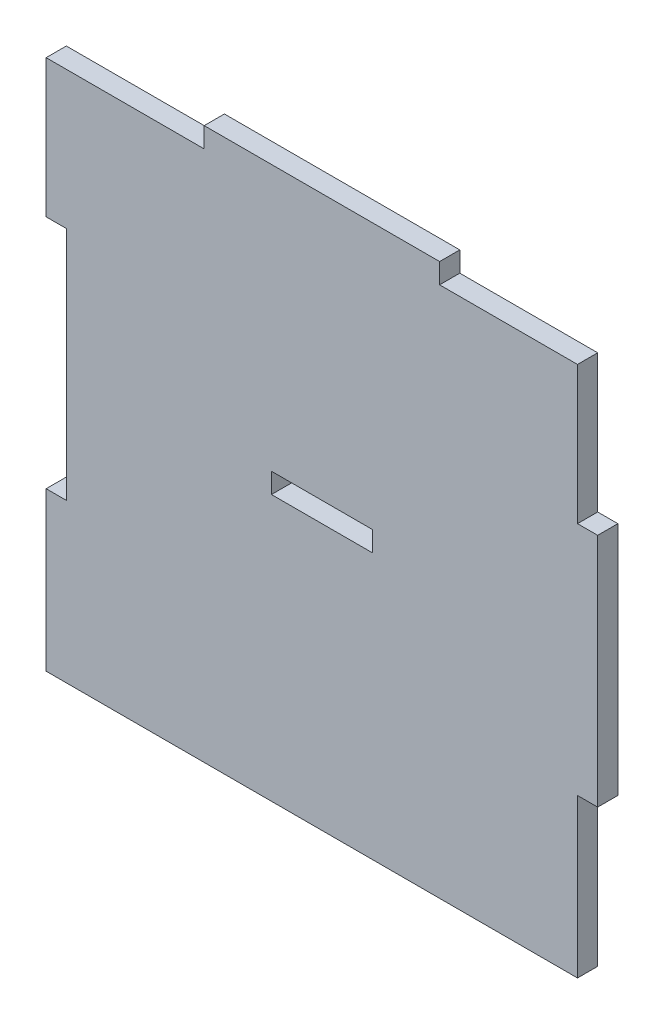
ISO-10303-21;
HEADER;
FILE_DESCRIPTION(('STEP AP214'),'2;1');
FILE_NAME('part.step','',(''),(''),'','','');
FILE_SCHEMA(('AUTOMOTIVE_DESIGN { 1 0 10303 214 1 1 1 1 }'));
ENDSEC;
DATA;
#1=APPLICATION_CONTEXT('core data for automotive mechanical design processes');
#2=APPLICATION_PROTOCOL_DEFINITION('international standard','automotive_design',2000,#1);
#3=PRODUCT_CONTEXT('',#1,'mechanical');
#4=PRODUCT('Part','Part','',(#3));
#5=PRODUCT_RELATED_PRODUCT_CATEGORY('part','',(#4));
#6=PRODUCT_DEFINITION_FORMATION('','',#4);
#7=PRODUCT_DEFINITION_CONTEXT('part definition',#1,'design');
#8=PRODUCT_DEFINITION('design','',#6,#7);
#9=PRODUCT_DEFINITION_SHAPE('','',#8);
#10=(LENGTH_UNIT() NAMED_UNIT(*) SI_UNIT(.MILLI.,.METRE.));
#11=(NAMED_UNIT(*) PLANE_ANGLE_UNIT() SI_UNIT($,.RADIAN.));
#12=(NAMED_UNIT(*) SI_UNIT($,.STERADIAN.) SOLID_ANGLE_UNIT());
#13=UNCERTAINTY_MEASURE_WITH_UNIT(LENGTH_MEASURE(1.E-05),#10,'distance_accuracy_value','');
#14=(GEOMETRIC_REPRESENTATION_CONTEXT(3) GLOBAL_UNCERTAINTY_ASSIGNED_CONTEXT((#13)) GLOBAL_UNIT_ASSIGNED_CONTEXT((#10,
#11,#12)) REPRESENTATION_CONTEXT('',''));
#15=CARTESIAN_POINT('',(0.,0.,0.));
#16=DIRECTION('',(0.,0.,1.));
#17=DIRECTION('',(1.,0.,0.));
#18=AXIS2_PLACEMENT_3D('',#15,#16,#17);
#19=CARTESIAN_POINT('',(38.,-16.,3.));
#20=DIRECTION('',(0.,1.,0.));
#21=DIRECTION('',(-1.,0.,0.));
#22=AXIS2_PLACEMENT_3D('',#19,#20,#21);
#23=PLANE('',#22);
#24=DIRECTION('',(1.,0.,0.));
#25=VECTOR('',#24,1.);
#26=CARTESIAN_POINT('',(38.,-16.,0.));
#27=LINE('',#26,#25);
#28=CARTESIAN_POINT('',(38.,-16.,0.));
#29=VERTEX_POINT('',#28);
#30=CARTESIAN_POINT('',(41.,-16.,0.));
#31=VERTEX_POINT('',#30);
#32=EDGE_CURVE('E207',#29,#31,#27,.T.);
#33=ORIENTED_EDGE('',*,*,#32,.T.);
#34=DIRECTION('',(0.,0.,-1.));
#35=VECTOR('',#34,1.);
#36=CARTESIAN_POINT('',(41.,-16.,3.));
#37=LINE('',#36,#35);
#38=CARTESIAN_POINT('',(41.,-16.,3.));
#39=VERTEX_POINT('',#38);
#40=EDGE_CURVE('E11',#39,#31,#37,.T.);
#41=ORIENTED_EDGE('',*,*,#40,.F.);
#42=DIRECTION('',(1.,0.,0.));
#43=VECTOR('',#42,1.);
#44=CARTESIAN_POINT('',(38.,-16.,3.));
#45=LINE('',#44,#43);
#46=CARTESIAN_POINT('',(38.,-16.,3.));
#47=VERTEX_POINT('',#46);
#48=EDGE_CURVE('E211',#47,#39,#45,.T.);
#49=ORIENTED_EDGE('',*,*,#48,.F.);
#50=DIRECTION('',(0.,0.,-1.));
#51=VECTOR('',#50,1.);
#52=CARTESIAN_POINT('',(38.,-16.,3.));
#53=LINE('',#52,#51);
#54=EDGE_CURVE('E245',#47,#29,#53,.T.);
#55=ORIENTED_EDGE('',*,*,#54,.T.);
#56=EDGE_LOOP('',(#33,#41,#49,#55));
#57=FACE_BOUND('',#56,.T.);
#58=ADVANCED_FACE('F38',(#57),#23,.F.);
#59=CARTESIAN_POINT('',(41.,16.,3.));
#60=DIRECTION('',(-1.,0.,0.));
#61=DIRECTION('',(0.,0.,1.));
#62=AXIS2_PLACEMENT_3D('',#59,#60,#61);
#63=PLANE('',#62);
#64=DIRECTION('',(0.,1.,0.));
#65=VECTOR('',#64,1.);
#66=CARTESIAN_POINT('',(41.,16.,0.));
#67=LINE('',#66,#65);
#68=CARTESIAN_POINT('',(41.,19.,0.));
#69=VERTEX_POINT('',#68);
#70=EDGE_CURVE('E248',#31,#69,#67,.T.);
#71=ORIENTED_EDGE('',*,*,#70,.T.);
#72=DIRECTION('',(0.,0.,-1.));
#73=VECTOR('',#72,1.);
#74=CARTESIAN_POINT('',(41.,19.,3.));
#75=LINE('',#74,#73);
#76=CARTESIAN_POINT('',(41.,19.,3.));
#77=VERTEX_POINT('',#76);
#78=EDGE_CURVE('E45',#77,#69,#75,.T.);
#79=ORIENTED_EDGE('',*,*,#78,.F.);
#80=DIRECTION('',(0.,1.,0.));
#81=VECTOR('',#80,1.);
#82=CARTESIAN_POINT('',(41.,16.,3.));
#83=LINE('',#82,#81);
#84=EDGE_CURVE('E214',#39,#77,#83,.T.);
#85=ORIENTED_EDGE('',*,*,#84,.F.);
#86=ORIENTED_EDGE('',*,*,#40,.T.);
#87=EDGE_LOOP('',(#71,#79,#85,#86));
#88=FACE_BOUND('',#87,.T.);
#89=ADVANCED_FACE('F347',(#88),#63,.F.);
#90=CARTESIAN_POINT('',(41.,19.,3.));
#91=DIRECTION('',(0.,-1.,0.));
#92=DIRECTION('',(0.,0.,-1.));
#93=AXIS2_PLACEMENT_3D('',#90,#91,#92);
#94=PLANE('',#93);
#95=DIRECTION('',(-1.,0.,0.));
#96=VECTOR('',#95,1.);
#97=CARTESIAN_POINT('',(41.,19.,0.));
#98=LINE('',#97,#96);
#99=CARTESIAN_POINT('',(38.,19.,0.));
#100=VERTEX_POINT('',#99);
#101=EDGE_CURVE('E250',#69,#100,#98,.T.);
#102=ORIENTED_EDGE('',*,*,#101,.T.);
#103=DIRECTION('',(0.,0.,-1.));
#104=VECTOR('',#103,1.);
#105=CARTESIAN_POINT('',(38.,19.,3.));
#106=LINE('',#105,#104);
#107=CARTESIAN_POINT('',(38.,19.,3.));
#108=VERTEX_POINT('',#107);
#109=EDGE_CURVE('E319',#108,#100,#106,.T.);
#110=ORIENTED_EDGE('',*,*,#109,.F.);
#111=DIRECTION('',(-1.,0.,0.));
#112=VECTOR('',#111,1.);
#113=CARTESIAN_POINT('',(41.,19.,3.));
#114=LINE('',#113,#112);
#115=EDGE_CURVE('E217',#77,#108,#114,.T.);
#116=ORIENTED_EDGE('',*,*,#115,.F.);
#117=ORIENTED_EDGE('',*,*,#78,.T.);
#118=EDGE_LOOP('',(#102,#110,#116,#117));
#119=FACE_BOUND('',#118,.T.);
#120=ADVANCED_FACE('F326',(#119),#94,.F.);
#121=CARTESIAN_POINT('',(38.,39.5,3.));
#122=DIRECTION('',(-1.,0.,0.));
#123=DIRECTION('',(0.,-1.,0.));
#124=AXIS2_PLACEMENT_3D('',#121,#122,#123);
#125=PLANE('',#124);
#126=DIRECTION('',(0.,1.,0.));
#127=VECTOR('',#126,1.);
#128=CARTESIAN_POINT('',(38.,39.5,0.));
#129=LINE('',#128,#127);
#130=CARTESIAN_POINT('',(38.,39.5,0.));
#131=VERTEX_POINT('',#130);
#132=EDGE_CURVE('E252',#100,#131,#129,.T.);
#133=ORIENTED_EDGE('',*,*,#132,.T.);
#134=DIRECTION('',(0.,0.,-1.));
#135=VECTOR('',#134,1.);
#136=CARTESIAN_POINT('',(38.,39.5,3.));
#137=LINE('',#136,#135);
#138=CARTESIAN_POINT('',(38.,39.5,3.));
#139=VERTEX_POINT('',#138);
#140=EDGE_CURVE('E316',#139,#131,#137,.T.);
#141=ORIENTED_EDGE('',*,*,#140,.F.);
#142=DIRECTION('',(0.,1.,0.));
#143=VECTOR('',#142,1.);
#144=CARTESIAN_POINT('',(38.,39.5,3.));
#145=LINE('',#144,#143);
#146=EDGE_CURVE('E219',#108,#139,#145,.T.);
#147=ORIENTED_EDGE('',*,*,#146,.F.);
#148=ORIENTED_EDGE('',*,*,#109,.T.);
#149=EDGE_LOOP('',(#133,#141,#147,#148));
#150=FACE_BOUND('',#149,.T.);
#151=ADVANCED_FACE('F335',(#150),#125,.F.);
#152=CARTESIAN_POINT('',(17.5,39.5,3.));
#153=DIRECTION('',(0.,-1.,0.));
#154=DIRECTION('',(1.,0.,0.));
#155=AXIS2_PLACEMENT_3D('',#152,#153,#154);
#156=PLANE('',#155);
#157=DIRECTION('',(-1.,0.,0.));
#158=VECTOR('',#157,1.);
#159=CARTESIAN_POINT('',(17.5,39.5,0.));
#160=LINE('',#159,#158);
#161=CARTESIAN_POINT('',(17.5,39.5,0.));
#162=VERTEX_POINT('',#161);
#163=EDGE_CURVE('E254',#131,#162,#160,.T.);
#164=ORIENTED_EDGE('',*,*,#163,.T.);
#165=DIRECTION('',(0.,0.,-1.));
#166=VECTOR('',#165,1.);
#167=CARTESIAN_POINT('',(17.5,39.5,3.));
#168=LINE('',#167,#166);
#169=CARTESIAN_POINT('',(17.5,39.5,3.));
#170=VERTEX_POINT('',#169);
#171=EDGE_CURVE('E313',#170,#162,#168,.T.);
#172=ORIENTED_EDGE('',*,*,#171,.F.);
#173=DIRECTION('',(-1.,0.,0.));
#174=VECTOR('',#173,1.);
#175=CARTESIAN_POINT('',(17.5,39.5,3.));
#176=LINE('',#175,#174);
#177=EDGE_CURVE('E221',#139,#170,#176,.T.);
#178=ORIENTED_EDGE('',*,*,#177,.F.);
#179=ORIENTED_EDGE('',*,*,#140,.T.);
#180=EDGE_LOOP('',(#164,#172,#178,#179));
#181=FACE_BOUND('',#180,.T.);
#182=ADVANCED_FACE('F339',(#181),#156,.F.);
#183=CARTESIAN_POINT('',(17.5,42.5,3.));
#184=DIRECTION('',(-1.,0.,0.));
#185=DIRECTION('',(0.,-1.,0.));
#186=AXIS2_PLACEMENT_3D('',#183,#184,#185);
#187=PLANE('',#186);
#188=DIRECTION('',(0.,1.,0.));
#189=VECTOR('',#188,1.);
#190=CARTESIAN_POINT('',(17.5,42.5,0.));
#191=LINE('',#190,#189);
#192=CARTESIAN_POINT('',(17.5,42.5,0.));
#193=VERTEX_POINT('',#192);
#194=EDGE_CURVE('E256',#162,#193,#191,.T.);
#195=ORIENTED_EDGE('',*,*,#194,.T.);
#196=DIRECTION('',(0.,0.,-1.));
#197=VECTOR('',#196,1.);
#198=CARTESIAN_POINT('',(17.5,42.5,3.));
#199=LINE('',#198,#197);
#200=CARTESIAN_POINT('',(17.5,42.5,3.));
#201=VERTEX_POINT('',#200);
#202=EDGE_CURVE('E310',#201,#193,#199,.T.);
#203=ORIENTED_EDGE('',*,*,#202,.F.);
#204=DIRECTION('',(0.,1.,0.));
#205=VECTOR('',#204,1.);
#206=CARTESIAN_POINT('',(17.5,42.5,3.));
#207=LINE('',#206,#205);
#208=EDGE_CURVE('E223',#170,#201,#207,.T.);
#209=ORIENTED_EDGE('',*,*,#208,.F.);
#210=ORIENTED_EDGE('',*,*,#171,.T.);
#211=EDGE_LOOP('',(#195,#203,#209,#210));
#212=FACE_BOUND('',#211,.T.);
#213=ADVANCED_FACE('F396',(#212),#187,.F.);
#214=CARTESIAN_POINT('',(-17.5,42.5,3.));
#215=DIRECTION('',(0.,-1.,0.));
#216=DIRECTION('',(0.,0.,-1.));
#217=AXIS2_PLACEMENT_3D('',#214,#215,#216);
#218=PLANE('',#217);
#219=DIRECTION('',(-1.,0.,0.));
#220=VECTOR('',#219,1.);
#221=CARTESIAN_POINT('',(-17.5,42.5,0.));
#222=LINE('',#221,#220);
#223=CARTESIAN_POINT('',(-17.5,42.5,0.));
#224=VERTEX_POINT('',#223);
#225=EDGE_CURVE('E258',#193,#224,#222,.T.);
#226=ORIENTED_EDGE('',*,*,#225,.T.);
#227=DIRECTION('',(0.,0.,-1.));
#228=VECTOR('',#227,1.);
#229=CARTESIAN_POINT('',(-17.5,42.5,3.));
#230=LINE('',#229,#228);
#231=CARTESIAN_POINT('',(-17.5,42.5,3.));
#232=VERTEX_POINT('',#231);
#233=EDGE_CURVE('E307',#232,#224,#230,.T.);
#234=ORIENTED_EDGE('',*,*,#233,.F.);
#235=DIRECTION('',(-1.,0.,0.));
#236=VECTOR('',#235,1.);
#237=CARTESIAN_POINT('',(-17.5,42.5,3.));
#238=LINE('',#237,#236);
#239=EDGE_CURVE('E225',#201,#232,#238,.T.);
#240=ORIENTED_EDGE('',*,*,#239,.F.);
#241=ORIENTED_EDGE('',*,*,#202,.T.);
#242=EDGE_LOOP('',(#226,#234,#240,#241));
#243=FACE_BOUND('',#242,.T.);
#244=ADVANCED_FACE('F394',(#243),#218,.F.);
#245=CARTESIAN_POINT('',(-17.5,39.5,3.));
#246=DIRECTION('',(1.,0.,0.));
#247=DIRECTION('',(0.,0.,-1.));
#248=AXIS2_PLACEMENT_3D('',#245,#246,#247);
#249=PLANE('',#248);
#250=DIRECTION('',(0.,-1.,0.));
#251=VECTOR('',#250,1.);
#252=CARTESIAN_POINT('',(-17.5,39.5,0.));
#253=LINE('',#252,#251);
#254=CARTESIAN_POINT('',(-17.5,39.5,0.));
#255=VERTEX_POINT('',#254);
#256=EDGE_CURVE('E260',#224,#255,#253,.T.);
#257=ORIENTED_EDGE('',*,*,#256,.T.);
#258=DIRECTION('',(0.,0.,-1.));
#259=VECTOR('',#258,1.);
#260=CARTESIAN_POINT('',(-17.5,39.5,3.));
#261=LINE('',#260,#259);
#262=CARTESIAN_POINT('',(-17.5,39.5,3.));
#263=VERTEX_POINT('',#262);
#264=EDGE_CURVE('E304',#263,#255,#261,.T.);
#265=ORIENTED_EDGE('',*,*,#264,.F.);
#266=DIRECTION('',(0.,-1.,0.));
#267=VECTOR('',#266,1.);
#268=CARTESIAN_POINT('',(-17.5,39.5,3.));
#269=LINE('',#268,#267);
#270=EDGE_CURVE('E227',#232,#263,#269,.T.);
#271=ORIENTED_EDGE('',*,*,#270,.F.);
#272=ORIENTED_EDGE('',*,*,#233,.T.);
#273=EDGE_LOOP('',(#257,#265,#271,#272));
#274=FACE_BOUND('',#273,.T.);
#275=ADVANCED_FACE('F387',(#274),#249,.F.);
#276=CARTESIAN_POINT('',(-41.,39.5,3.));
#277=DIRECTION('',(0.,-1.,0.));
#278=DIRECTION('',(0.,0.,-1.));
#279=AXIS2_PLACEMENT_3D('',#276,#277,#278);
#280=PLANE('',#279);
#281=DIRECTION('',(-1.,0.,0.));
#282=VECTOR('',#281,1.);
#283=CARTESIAN_POINT('',(-41.,39.5,0.));
#284=LINE('',#283,#282);
#285=CARTESIAN_POINT('',(-41.,39.5,0.));
#286=VERTEX_POINT('',#285);
#287=EDGE_CURVE('E263',#255,#286,#284,.T.);
#288=ORIENTED_EDGE('',*,*,#287,.T.);
#289=DIRECTION('',(0.,0.,-1.));
#290=VECTOR('',#289,1.);
#291=CARTESIAN_POINT('',(-41.,39.5,3.));
#292=LINE('',#291,#290);
#293=CARTESIAN_POINT('',(-41.,39.5,3.));
#294=VERTEX_POINT('',#293);
#295=EDGE_CURVE('E301',#294,#286,#292,.T.);
#296=ORIENTED_EDGE('',*,*,#295,.F.);
#297=DIRECTION('',(-1.,0.,0.));
#298=VECTOR('',#297,1.);
#299=CARTESIAN_POINT('',(-38.,39.5,3.));
#300=LINE('',#299,#298);
#301=EDGE_CURVE('E229',#263,#294,#300,.T.);
#302=ORIENTED_EDGE('',*,*,#301,.F.);
#303=ORIENTED_EDGE('',*,*,#264,.T.);
#304=EDGE_LOOP('',(#288,#296,#302,#303));
#305=FACE_BOUND('',#304,.T.);
#306=ADVANCED_FACE('F391',(#305),#280,.F.);
#307=CARTESIAN_POINT('',(-41.,19.,3.));
#308=DIRECTION('',(1.,0.,0.));
#309=DIRECTION('',(0.,1.,0.));
#310=AXIS2_PLACEMENT_3D('',#307,#308,#309);
#311=PLANE('',#310);
#312=DIRECTION('',(0.,-1.,0.));
#313=VECTOR('',#312,1.);
#314=CARTESIAN_POINT('',(-41.,19.,0.));
#315=LINE('',#314,#313);
#316=CARTESIAN_POINT('',(-41.,19.,0.));
#317=VERTEX_POINT('',#316);
#318=EDGE_CURVE('E265',#286,#317,#315,.T.);
#319=ORIENTED_EDGE('',*,*,#318,.T.);
#320=DIRECTION('',(0.,0.,-1.));
#321=VECTOR('',#320,1.);
#322=CARTESIAN_POINT('',(-41.,19.,3.));
#323=LINE('',#322,#321);
#324=CARTESIAN_POINT('',(-41.,19.,3.));
#325=VERTEX_POINT('',#324);
#326=EDGE_CURVE('E298',#325,#317,#323,.T.);
#327=ORIENTED_EDGE('',*,*,#326,.F.);
#328=DIRECTION('',(0.,-1.,0.));
#329=VECTOR('',#328,1.);
#330=CARTESIAN_POINT('',(-41.,19.,3.));
#331=LINE('',#330,#329);
#332=EDGE_CURVE('E231',#294,#325,#331,.T.);
#333=ORIENTED_EDGE('',*,*,#332,.F.);
#334=ORIENTED_EDGE('',*,*,#295,.T.);
#335=EDGE_LOOP('',(#319,#327,#333,#334));
#336=FACE_BOUND('',#335,.T.);
#337=ADVANCED_FACE('F380',(#336),#311,.F.);
#338=CARTESIAN_POINT('',(-38.,19.,3.));
#339=DIRECTION('',(0.,1.,0.));
#340=DIRECTION('',(-1.,0.,0.));
#341=AXIS2_PLACEMENT_3D('',#338,#339,#340);
#342=PLANE('',#341);
#343=DIRECTION('',(1.,0.,0.));
#344=VECTOR('',#343,1.);
#345=CARTESIAN_POINT('',(-38.,19.,0.));
#346=LINE('',#345,#344);
#347=CARTESIAN_POINT('',(-38.,19.,0.));
#348=VERTEX_POINT('',#347);
#349=EDGE_CURVE('E267',#317,#348,#346,.T.);
#350=ORIENTED_EDGE('',*,*,#349,.T.);
#351=DIRECTION('',(0.,0.,-1.));
#352=VECTOR('',#351,1.);
#353=CARTESIAN_POINT('',(-38.,19.,3.));
#354=LINE('',#353,#352);
#355=CARTESIAN_POINT('',(-38.,19.,3.));
#356=VERTEX_POINT('',#355);
#357=EDGE_CURVE('E295',#356,#348,#354,.T.);
#358=ORIENTED_EDGE('',*,*,#357,.F.);
#359=DIRECTION('',(1.,0.,0.));
#360=VECTOR('',#359,1.);
#361=CARTESIAN_POINT('',(-38.,19.,3.));
#362=LINE('',#361,#360);
#363=EDGE_CURVE('E233',#325,#356,#362,.T.);
#364=ORIENTED_EDGE('',*,*,#363,.F.);
#365=ORIENTED_EDGE('',*,*,#326,.T.);
#366=EDGE_LOOP('',(#350,#358,#364,#365));
#367=FACE_BOUND('',#366,.T.);
#368=ADVANCED_FACE('F375',(#367),#342,.F.);
#369=CARTESIAN_POINT('',(-38.,16.,3.));
#370=DIRECTION('',(1.,0.,0.));
#371=DIRECTION('',(0.,0.,-1.));
#372=AXIS2_PLACEMENT_3D('',#369,#370,#371);
#373=PLANE('',#372);
#374=DIRECTION('',(0.,-1.,0.));
#375=VECTOR('',#374,1.);
#376=CARTESIAN_POINT('',(-38.,16.,0.));
#377=LINE('',#376,#375);
#378=CARTESIAN_POINT('',(-38.,-16.,0.));
#379=VERTEX_POINT('',#378);
#380=EDGE_CURVE('E270',#348,#379,#377,.T.);
#381=ORIENTED_EDGE('',*,*,#380,.T.);
#382=DIRECTION('',(0.,0.,-1.));
#383=VECTOR('',#382,1.);
#384=CARTESIAN_POINT('',(-38.,-16.,3.));
#385=LINE('',#384,#383);
#386=CARTESIAN_POINT('',(-38.,-16.,3.));
#387=VERTEX_POINT('',#386);
#388=EDGE_CURVE('E292',#387,#379,#385,.T.);
#389=ORIENTED_EDGE('',*,*,#388,.F.);
#390=DIRECTION('',(0.,-1.,0.));
#391=VECTOR('',#390,1.);
#392=CARTESIAN_POINT('',(-38.,16.,3.));
#393=LINE('',#392,#391);
#394=EDGE_CURVE('E235',#356,#387,#393,.T.);
#395=ORIENTED_EDGE('',*,*,#394,.F.);
#396=ORIENTED_EDGE('',*,*,#357,.T.);
#397=EDGE_LOOP('',(#381,#389,#395,#396));
#398=FACE_BOUND('',#397,.T.);
#399=ADVANCED_FACE('F370',(#398),#373,.F.);
#400=CARTESIAN_POINT('',(-41.,-16.,3.));
#401=DIRECTION('',(0.,-1.,0.));
#402=DIRECTION('',(0.,0.,-1.));
#403=AXIS2_PLACEMENT_3D('',#400,#401,#402);
#404=PLANE('',#403);
#405=DIRECTION('',(-1.,0.,0.));
#406=VECTOR('',#405,1.);
#407=CARTESIAN_POINT('',(-41.,-16.,0.));
#408=LINE('',#407,#406);
#409=CARTESIAN_POINT('',(-41.,-16.,0.));
#410=VERTEX_POINT('',#409);
#411=EDGE_CURVE('E272',#379,#410,#408,.T.);
#412=ORIENTED_EDGE('',*,*,#411,.T.);
#413=DIRECTION('',(0.,0.,-1.));
#414=VECTOR('',#413,1.);
#415=CARTESIAN_POINT('',(-41.,-16.,3.));
#416=LINE('',#415,#414);
#417=CARTESIAN_POINT('',(-41.,-16.,3.));
#418=VERTEX_POINT('',#417);
#419=EDGE_CURVE('E289',#418,#410,#416,.T.);
#420=ORIENTED_EDGE('',*,*,#419,.F.);
#421=DIRECTION('',(-1.,0.,0.));
#422=VECTOR('',#421,1.);
#423=CARTESIAN_POINT('',(-41.,-16.,3.));
#424=LINE('',#423,#422);
#425=EDGE_CURVE('E237',#387,#418,#424,.T.);
#426=ORIENTED_EDGE('',*,*,#425,.F.);
#427=ORIENTED_EDGE('',*,*,#388,.T.);
#428=EDGE_LOOP('',(#412,#420,#426,#427));
#429=FACE_BOUND('',#428,.T.);
#430=ADVANCED_FACE('F366',(#429),#404,.F.);
#431=CARTESIAN_POINT('',(-41.,-19.,3.));
#432=DIRECTION('',(1.,0.,0.));
#433=DIRECTION('',(0.,1.,0.));
#434=AXIS2_PLACEMENT_3D('',#431,#432,#433);
#435=PLANE('',#434);
#436=DIRECTION('',(0.,-1.,0.));
#437=VECTOR('',#436,1.);
#438=CARTESIAN_POINT('',(-41.,-19.,0.));
#439=LINE('',#438,#437);
#440=CARTESIAN_POINT('',(-41.,-39.5,0.));
#441=VERTEX_POINT('',#440);
#442=EDGE_CURVE('E275',#410,#441,#439,.T.);
#443=ORIENTED_EDGE('',*,*,#442,.T.);
#444=DIRECTION('',(0.,0.,-1.));
#445=VECTOR('',#444,1.);
#446=CARTESIAN_POINT('',(-41.,-39.5,3.));
#447=LINE('',#446,#445);
#448=CARTESIAN_POINT('',(-41.,-39.5,3.));
#449=VERTEX_POINT('',#448);
#450=EDGE_CURVE('E286',#449,#441,#447,.T.);
#451=ORIENTED_EDGE('',*,*,#450,.F.);
#452=DIRECTION('',(0.,-1.,0.));
#453=VECTOR('',#452,1.);
#454=CARTESIAN_POINT('',(-41.,-19.,3.));
#455=LINE('',#454,#453);
#456=EDGE_CURVE('E239',#418,#449,#455,.T.);
#457=ORIENTED_EDGE('',*,*,#456,.F.);
#458=ORIENTED_EDGE('',*,*,#419,.T.);
#459=EDGE_LOOP('',(#443,#451,#457,#458));
#460=FACE_BOUND('',#459,.T.);
#461=ADVANCED_FACE('F363',(#460),#435,.F.);
#462=CARTESIAN_POINT('',(-41.,-39.5,3.));
#463=DIRECTION('',(0.,1.,0.));
#464=DIRECTION('',(0.,0.,1.));
#465=AXIS2_PLACEMENT_3D('',#462,#463,#464);
#466=PLANE('',#465);
#467=DIRECTION('',(1.,0.,0.));
#468=VECTOR('',#467,1.);
#469=CARTESIAN_POINT('',(-41.,-39.5,0.));
#470=LINE('',#469,#468);
#471=CARTESIAN_POINT('',(38.,-39.5,0.));
#472=VERTEX_POINT('',#471);
#473=EDGE_CURVE('E277',#441,#472,#470,.T.);
#474=ORIENTED_EDGE('',*,*,#473,.T.);
#475=DIRECTION('',(0.,0.,-1.));
#476=VECTOR('',#475,1.);
#477=CARTESIAN_POINT('',(38.,-39.5,3.));
#478=LINE('',#477,#476);
#479=CARTESIAN_POINT('',(38.,-39.5,3.));
#480=VERTEX_POINT('',#479);
#481=EDGE_CURVE('E283',#480,#472,#478,.T.);
#482=ORIENTED_EDGE('',*,*,#481,.F.);
#483=DIRECTION('',(1.,0.,0.));
#484=VECTOR('',#483,1.);
#485=CARTESIAN_POINT('',(-41.,-39.5,3.));
#486=LINE('',#485,#484);
#487=EDGE_CURVE('E241',#449,#480,#486,.T.);
#488=ORIENTED_EDGE('',*,*,#487,.F.);
#489=ORIENTED_EDGE('',*,*,#450,.T.);
#490=EDGE_LOOP('',(#474,#482,#488,#489));
#491=FACE_BOUND('',#490,.T.);
#492=ADVANCED_FACE('F354',(#491),#466,.F.);
#493=CARTESIAN_POINT('',(38.,-19.,3.));
#494=DIRECTION('',(-1.,0.,0.));
#495=DIRECTION('',(0.,-1.,0.));
#496=AXIS2_PLACEMENT_3D('',#493,#494,#495);
#497=PLANE('',#496);
#498=DIRECTION('',(0.,1.,0.));
#499=VECTOR('',#498,1.);
#500=CARTESIAN_POINT('',(38.,-19.,0.));
#501=LINE('',#500,#499);
#502=EDGE_CURVE('E215',#472,#29,#501,.T.);
#503=ORIENTED_EDGE('',*,*,#502,.T.);
#504=ORIENTED_EDGE('',*,*,#54,.F.);
#505=DIRECTION('',(0.,1.,0.));
#506=VECTOR('',#505,1.);
#507=CARTESIAN_POINT('',(38.,-19.,3.));
#508=LINE('',#507,#506);
#509=EDGE_CURVE('E243',#480,#47,#508,.T.);
#510=ORIENTED_EDGE('',*,*,#509,.F.);
#511=ORIENTED_EDGE('',*,*,#481,.T.);
#512=EDGE_LOOP('',(#503,#504,#510,#511));
#513=FACE_BOUND('',#512,.T.);
#514=ADVANCED_FACE('F358',(#513),#497,.F.);
#515=CARTESIAN_POINT('',(0.,0.,3.));
#516=DIRECTION('',(0.,0.,-1.));
#517=DIRECTION('',(-1.,0.,0.));
#518=AXIS2_PLACEMENT_3D('',#515,#516,#517);
#519=PLANE('',#518);
#520=DIRECTION('',(-1.,0.,0.));
#521=VECTOR('',#520,1.);
#522=CARTESIAN_POINT('',(-7.5,3.,3.));
#523=LINE('',#522,#521);
#524=CARTESIAN_POINT('',(7.5,3.,3.));
#525=VERTEX_POINT('',#524);
#526=CARTESIAN_POINT('',(-7.5,3.,3.));
#527=VERTEX_POINT('',#526);
#528=EDGE_CURVE('E201',#525,#527,#523,.T.);
#529=ORIENTED_EDGE('',*,*,#528,.F.);
#530=DIRECTION('',(0.,1.,0.));
#531=VECTOR('',#530,1.);
#532=CARTESIAN_POINT('',(7.5,3.,3.));
#533=LINE('',#532,#531);
#534=CARTESIAN_POINT('',(7.5,0.,3.));
#535=VERTEX_POINT('',#534);
#536=EDGE_CURVE('E52',#535,#525,#533,.T.);
#537=ORIENTED_EDGE('',*,*,#536,.F.);
#538=DIRECTION('',(1.,0.,0.));
#539=VECTOR('',#538,1.);
#540=CARTESIAN_POINT('',(-7.5,0.,3.));
#541=LINE('',#540,#539);
#542=CARTESIAN_POINT('',(-7.5,0.,3.));
#543=VERTEX_POINT('',#542);
#544=EDGE_CURVE('E192',#543,#535,#541,.T.);
#545=ORIENTED_EDGE('',*,*,#544,.F.);
#546=DIRECTION('',(0.,-1.,0.));
#547=VECTOR('',#546,1.);
#548=CARTESIAN_POINT('',(-7.5,3.,3.));
#549=LINE('',#548,#547);
#550=EDGE_CURVE('E195',#527,#543,#549,.T.);
#551=ORIENTED_EDGE('',*,*,#550,.F.);
#552=EDGE_LOOP('',(#529,#537,#545,#551));
#553=FACE_BOUND('',#552,.T.);
#554=ORIENTED_EDGE('',*,*,#48,.T.);
#555=ORIENTED_EDGE('',*,*,#84,.T.);
#556=ORIENTED_EDGE('',*,*,#115,.T.);
#557=ORIENTED_EDGE('',*,*,#146,.T.);
#558=ORIENTED_EDGE('',*,*,#177,.T.);
#559=ORIENTED_EDGE('',*,*,#208,.T.);
#560=ORIENTED_EDGE('',*,*,#239,.T.);
#561=ORIENTED_EDGE('',*,*,#270,.T.);
#562=ORIENTED_EDGE('',*,*,#301,.T.);
#563=ORIENTED_EDGE('',*,*,#332,.T.);
#564=ORIENTED_EDGE('',*,*,#363,.T.);
#565=ORIENTED_EDGE('',*,*,#394,.T.);
#566=ORIENTED_EDGE('',*,*,#425,.T.);
#567=ORIENTED_EDGE('',*,*,#456,.T.);
#568=ORIENTED_EDGE('',*,*,#487,.T.);
#569=ORIENTED_EDGE('',*,*,#509,.T.);
#570=EDGE_LOOP('',(#554,#555,#556,#557,#558,#559,#560,#561,#562,#563,#564,#565,#566,#567,#568,#569));
#571=FACE_BOUND('',#570,.T.);
#572=ADVANCED_FACE('F343',(#553,#571),#519,.F.);
#573=CARTESIAN_POINT('',(0.,0.,0.));
#574=DIRECTION('',(0.,0.,-1.));
#575=DIRECTION('',(-1.,0.,0.));
#576=AXIS2_PLACEMENT_3D('',#573,#574,#575);
#577=PLANE('',#576);
#578=DIRECTION('',(0.,1.,0.));
#579=VECTOR('',#578,1.);
#580=CARTESIAN_POINT('',(7.5,3.,0.));
#581=LINE('',#580,#579);
#582=CARTESIAN_POINT('',(7.5,0.,0.));
#583=VERTEX_POINT('',#582);
#584=CARTESIAN_POINT('',(7.5,3.,0.));
#585=VERTEX_POINT('',#584);
#586=EDGE_CURVE('E176',#583,#585,#581,.T.);
#587=ORIENTED_EDGE('',*,*,#586,.T.);
#588=DIRECTION('',(-1.,0.,0.));
#589=VECTOR('',#588,1.);
#590=CARTESIAN_POINT('',(-7.5,3.,0.));
#591=LINE('',#590,#589);
#592=CARTESIAN_POINT('',(-7.5,3.,0.));
#593=VERTEX_POINT('',#592);
#594=EDGE_CURVE('E185',#585,#593,#591,.T.);
#595=ORIENTED_EDGE('',*,*,#594,.T.);
#596=DIRECTION('',(0.,-1.,0.));
#597=VECTOR('',#596,1.);
#598=CARTESIAN_POINT('',(-7.5,3.,0.));
#599=LINE('',#598,#597);
#600=CARTESIAN_POINT('',(-7.5,0.,0.));
#601=VERTEX_POINT('',#600);
#602=EDGE_CURVE('E60',#593,#601,#599,.T.);
#603=ORIENTED_EDGE('',*,*,#602,.T.);
#604=DIRECTION('',(1.,0.,0.));
#605=VECTOR('',#604,1.);
#606=CARTESIAN_POINT('',(-7.5,0.,0.));
#607=LINE('',#606,#605);
#608=EDGE_CURVE('E182',#601,#583,#607,.T.);
#609=ORIENTED_EDGE('',*,*,#608,.T.);
#610=EDGE_LOOP('',(#587,#595,#603,#609));
#611=FACE_BOUND('',#610,.T.);
#612=ORIENTED_EDGE('',*,*,#32,.F.);
#613=ORIENTED_EDGE('',*,*,#502,.F.);
#614=ORIENTED_EDGE('',*,*,#473,.F.);
#615=ORIENTED_EDGE('',*,*,#442,.F.);
#616=ORIENTED_EDGE('',*,*,#411,.F.);
#617=ORIENTED_EDGE('',*,*,#380,.F.);
#618=ORIENTED_EDGE('',*,*,#349,.F.);
#619=ORIENTED_EDGE('',*,*,#318,.F.);
#620=ORIENTED_EDGE('',*,*,#287,.F.);
#621=ORIENTED_EDGE('',*,*,#256,.F.);
#622=ORIENTED_EDGE('',*,*,#225,.F.);
#623=ORIENTED_EDGE('',*,*,#194,.F.);
#624=ORIENTED_EDGE('',*,*,#163,.F.);
#625=ORIENTED_EDGE('',*,*,#132,.F.);
#626=ORIENTED_EDGE('',*,*,#101,.F.);
#627=ORIENTED_EDGE('',*,*,#70,.F.);
#628=EDGE_LOOP('',(#612,#613,#614,#615,#616,#617,#618,#619,#620,#621,#622,#623,#624,#625,#626,#627));
#629=FACE_BOUND('',#628,.T.);
#630=ADVANCED_FACE('F189',(#611,#629),#577,.T.);
#631=CARTESIAN_POINT('',(7.5,3.,0.));
#632=DIRECTION('',(1.,0.,0.));
#633=DIRECTION('',(0.,1.,0.));
#634=AXIS2_PLACEMENT_3D('',#631,#632,#633);
#635=PLANE('',#634);
#636=ORIENTED_EDGE('',*,*,#536,.T.);
#637=DIRECTION('',(0.,0.,1.));
#638=VECTOR('',#637,1.);
#639=CARTESIAN_POINT('',(7.5,3.,0.));
#640=LINE('',#639,#638);
#641=EDGE_CURVE('E172',#585,#525,#640,.T.);
#642=ORIENTED_EDGE('',*,*,#641,.F.);
#643=ORIENTED_EDGE('',*,*,#586,.F.);
#644=DIRECTION('',(0.,0.,1.));
#645=VECTOR('',#644,1.);
#646=CARTESIAN_POINT('',(7.5,0.,0.));
#647=LINE('',#646,#645);
#648=EDGE_CURVE('E205',#583,#535,#647,.T.);
#649=ORIENTED_EDGE('',*,*,#648,.T.);
#650=EDGE_LOOP('',(#636,#642,#643,#649));
#651=FACE_BOUND('',#650,.T.);
#652=ADVANCED_FACE('F174',(#651),#635,.F.);
#653=CARTESIAN_POINT('',(-7.5,0.,0.));
#654=DIRECTION('',(0.,-1.,0.));
#655=DIRECTION('',(0.,0.,-1.));
#656=AXIS2_PLACEMENT_3D('',#653,#654,#655);
#657=PLANE('',#656);
#658=ORIENTED_EDGE('',*,*,#544,.T.);
#659=ORIENTED_EDGE('',*,*,#648,.F.);
#660=ORIENTED_EDGE('',*,*,#608,.F.);
#661=DIRECTION('',(0.,0.,1.));
#662=VECTOR('',#661,1.);
#663=CARTESIAN_POINT('',(-7.5,0.,0.));
#664=LINE('',#663,#662);
#665=EDGE_CURVE('E208',#601,#543,#664,.T.);
#666=ORIENTED_EDGE('',*,*,#665,.T.);
#667=EDGE_LOOP('',(#658,#659,#660,#666));
#668=FACE_BOUND('',#667,.T.);
#669=ADVANCED_FACE('F535',(#668),#657,.F.);
#670=CARTESIAN_POINT('',(-7.5,3.,0.));
#671=DIRECTION('',(-1.,0.,0.));
#672=DIRECTION('',(0.,-1.,0.));
#673=AXIS2_PLACEMENT_3D('',#670,#671,#672);
#674=PLANE('',#673);
#675=ORIENTED_EDGE('',*,*,#550,.T.);
#676=ORIENTED_EDGE('',*,*,#665,.F.);
#677=ORIENTED_EDGE('',*,*,#602,.F.);
#678=DIRECTION('',(0.,0.,1.));
#679=VECTOR('',#678,1.);
#680=CARTESIAN_POINT('',(-7.5,3.,0.));
#681=LINE('',#680,#679);
#682=EDGE_CURVE('E181',#593,#527,#681,.T.);
#683=ORIENTED_EDGE('',*,*,#682,.T.);
#684=EDGE_LOOP('',(#675,#676,#677,#683));
#685=FACE_BOUND('',#684,.T.);
#686=ADVANCED_FACE('F544',(#685),#674,.F.);
#687=CARTESIAN_POINT('',(-7.5,3.,0.));
#688=DIRECTION('',(0.,1.,0.));
#689=DIRECTION('',(0.,0.,1.));
#690=AXIS2_PLACEMENT_3D('',#687,#688,#689);
#691=PLANE('',#690);
#692=ORIENTED_EDGE('',*,*,#528,.T.);
#693=ORIENTED_EDGE('',*,*,#682,.F.);
#694=ORIENTED_EDGE('',*,*,#594,.F.);
#695=ORIENTED_EDGE('',*,*,#641,.T.);
#696=EDGE_LOOP('',(#692,#693,#694,#695));
#697=FACE_BOUND('',#696,.T.);
#698=ADVANCED_FACE('F186',(#697),#691,.F.);
#699=CLOSED_SHELL('',(#58,#89,#120,#151,#182,#213,#244,#275,#306,#337,#368,#399,#430,#461,#492,
#514,#572,#630,#652,#669,#686,#698));
#700=MANIFOLD_SOLID_BREP('B2',#699);
#701=ADVANCED_BREP_SHAPE_REPRESENTATION('',(#18,#700),#14);
#702=SHAPE_DEFINITION_REPRESENTATION(#9,#701);
ENDSEC;
END-ISO-10303-21;
